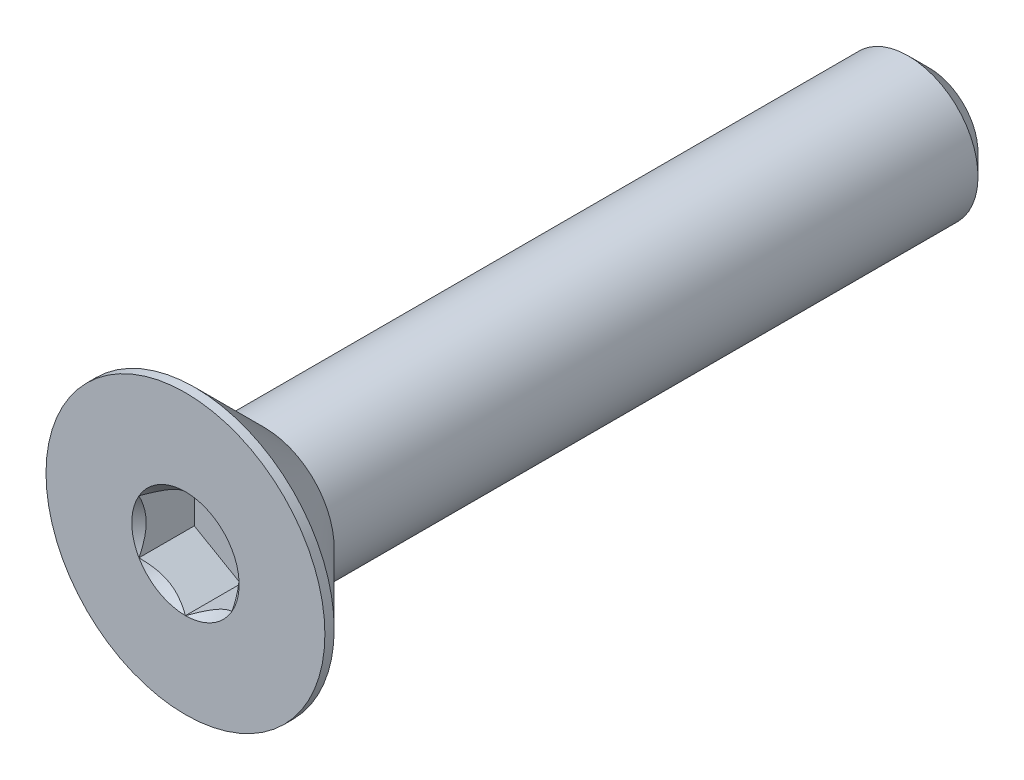
ISO-10303-21;
HEADER;
FILE_DESCRIPTION(('STEP AP214'),'2;1');
FILE_NAME('part.step','',(''),(''),'','','');
FILE_SCHEMA(('AUTOMOTIVE_DESIGN { 1 0 10303 214 1 1 1 1 }'));
ENDSEC;
DATA;
#1=APPLICATION_CONTEXT('core data for automotive mechanical design processes');
#2=APPLICATION_PROTOCOL_DEFINITION('international standard','automotive_design',2000,#1);
#3=PRODUCT_CONTEXT('',#1,'mechanical');
#4=PRODUCT('Part','Part','',(#3));
#5=PRODUCT_RELATED_PRODUCT_CATEGORY('part','',(#4));
#6=PRODUCT_DEFINITION_FORMATION('','',#4);
#7=PRODUCT_DEFINITION_CONTEXT('part definition',#1,'design');
#8=PRODUCT_DEFINITION('design','',#6,#7);
#9=PRODUCT_DEFINITION_SHAPE('','',#8);
#10=(LENGTH_UNIT() NAMED_UNIT(*) SI_UNIT(.MILLI.,.METRE.));
#11=(NAMED_UNIT(*) PLANE_ANGLE_UNIT() SI_UNIT($,.RADIAN.));
#12=(NAMED_UNIT(*) SI_UNIT($,.STERADIAN.) SOLID_ANGLE_UNIT());
#13=UNCERTAINTY_MEASURE_WITH_UNIT(LENGTH_MEASURE(1.E-05),#10,'distance_accuracy_value','');
#14=(GEOMETRIC_REPRESENTATION_CONTEXT(3) GLOBAL_UNCERTAINTY_ASSIGNED_CONTEXT((#13)) GLOBAL_UNIT_ASSIGNED_CONTEXT((#10,
#11,#12)) REPRESENTATION_CONTEXT('',''));
#15=CARTESIAN_POINT('',(0.,0.,0.));
#16=DIRECTION('',(0.,0.,1.));
#17=DIRECTION('',(1.,0.,0.));
#18=AXIS2_PLACEMENT_3D('',#15,#16,#17);
#19=CARTESIAN_POINT('',(0.,0.,-8.));
#20=DIRECTION('',(0.,0.,-1.));
#21=DIRECTION('',(0.,1.,0.));
#22=AXIS2_PLACEMENT_3D('',#19,#20,#21);
#23=CYLINDRICAL_SURFACE('',#22,1.5);
#24=CARTESIAN_POINT('',(0.,0.,6.3));
#25=DIRECTION('',(0.,0.,-1.));
#26=DIRECTION('',(0.,1.,0.));
#27=AXIS2_PLACEMENT_3D('',#24,#25,#26);
#28=CIRCLE('',#27,1.5);
#29=CARTESIAN_POINT('',(0.,1.5,6.3));
#30=VERTEX_POINT('',#29);
#31=EDGE_CURVE('E11',#30,#30,#28,.F.);
#32=ORIENTED_EDGE('',*,*,#31,.F.);
#33=EDGE_LOOP('',(#32));
#34=FACE_BOUND('',#33,.T.);
#35=CARTESIAN_POINT('',(0.,0.,-7.55));
#36=DIRECTION('',(0.,0.,-1.));
#37=DIRECTION('',(0.,1.,0.));
#38=AXIS2_PLACEMENT_3D('',#35,#36,#37);
#39=CIRCLE('',#38,1.5);
#40=CARTESIAN_POINT('',(0.,1.5,-7.55));
#41=VERTEX_POINT('',#40);
#42=EDGE_CURVE('E47',#41,#41,#39,.F.);
#43=ORIENTED_EDGE('',*,*,#42,.T.);
#44=EDGE_LOOP('',(#43));
#45=FACE_BOUND('',#44,.T.);
#46=ADVANCED_FACE('F39',(#34,#45),#23,.T.);
#47=CARTESIAN_POINT('',(0.,1.5,-8.));
#48=DIRECTION('',(0.,0.,-1.));
#49=DIRECTION('',(0.,1.,0.));
#50=AXIS2_PLACEMENT_3D('',#47,#48,#49);
#51=PLANE('',#50);
#52=CARTESIAN_POINT('',(0.,0.,-8.));
#53=DIRECTION('',(0.,0.,-1.));
#54=DIRECTION('',(0.,1.,0.));
#55=AXIS2_PLACEMENT_3D('',#52,#53,#54);
#56=CIRCLE('',#55,1.05);
#57=CARTESIAN_POINT('',(0.,1.05,-8.));
#58=VERTEX_POINT('',#57);
#59=EDGE_CURVE('E151',#58,#58,#56,.T.);
#60=ORIENTED_EDGE('',*,*,#59,.T.);
#61=EDGE_LOOP('',(#60));
#62=FACE_BOUND('',#61,.T.);
#63=ADVANCED_FACE('F160',(#62),#51,.T.);
#64=CARTESIAN_POINT('',(0.,0.,-8.));
#65=DIRECTION('',(0.,0.,1.));
#66=DIRECTION('',(0.,-1.,0.));
#67=AXIS2_PLACEMENT_3D('',#64,#65,#66);
#68=CONICAL_SURFACE('',#67,1.05,0.785398163397447);
#69=ORIENTED_EDGE('',*,*,#42,.F.);
#70=EDGE_LOOP('',(#69));
#71=FACE_BOUND('',#70,.T.);
#72=ORIENTED_EDGE('',*,*,#59,.F.);
#73=EDGE_LOOP('',(#72));
#74=FACE_BOUND('',#73,.T.);
#75=ADVANCED_FACE('F41',(#71,#74),#68,.T.);
#76=CARTESIAN_POINT('',(0.,0.,-8.));
#77=DIRECTION('',(0.,0.,-1.));
#78=DIRECTION('',(0.,1.,0.));
#79=AXIS2_PLACEMENT_3D('',#76,#77,#78);
#80=CYLINDRICAL_SURFACE('',#79,3.);
#81=CARTESIAN_POINT('',(0.,0.,8.));
#82=DIRECTION('',(0.,0.,-1.));
#83=DIRECTION('',(0.,1.,0.));
#84=AXIS2_PLACEMENT_3D('',#81,#82,#83);
#85=CIRCLE('',#84,3.);
#86=CARTESIAN_POINT('',(0.,3.,8.));
#87=VERTEX_POINT('',#86);
#88=EDGE_CURVE('E131',#87,#87,#85,.T.);
#89=ORIENTED_EDGE('',*,*,#88,.T.);
#90=EDGE_LOOP('',(#89));
#91=FACE_BOUND('',#90,.T.);
#92=CARTESIAN_POINT('',(0.,0.,7.79999999999999));
#93=DIRECTION('',(0.,0.,-1.));
#94=DIRECTION('',(0.,1.,0.));
#95=AXIS2_PLACEMENT_3D('',#92,#93,#94);
#96=CIRCLE('',#95,3.);
#97=CARTESIAN_POINT('',(0.,3.,7.79999999999999));
#98=VERTEX_POINT('',#97);
#99=EDGE_CURVE('E128',#98,#98,#96,.T.);
#100=ORIENTED_EDGE('',*,*,#99,.F.);
#101=EDGE_LOOP('',(#100));
#102=FACE_BOUND('',#101,.T.);
#103=ADVANCED_FACE('F159',(#91,#102),#80,.T.);
#104=CARTESIAN_POINT('',(0.,0.,6.3));
#105=DIRECTION('',(0.,0.,1.));
#106=DIRECTION('',(0.,-1.,0.));
#107=AXIS2_PLACEMENT_3D('',#104,#105,#106);
#108=CONICAL_SURFACE('',#107,1.5,0.78539816339745);
#109=ORIENTED_EDGE('',*,*,#99,.T.);
#110=EDGE_LOOP('',(#109));
#111=FACE_BOUND('',#110,.T.);
#112=ORIENTED_EDGE('',*,*,#31,.T.);
#113=EDGE_LOOP('',(#112));
#114=FACE_BOUND('',#113,.T.);
#115=ADVANCED_FACE('F173',(#111,#114),#108,.T.);
#116=CARTESIAN_POINT('',(0.,0.,8.));
#117=DIRECTION('',(0.,0.,1.));
#118=DIRECTION('',(0.,-1.,0.));
#119=AXIS2_PLACEMENT_3D('',#116,#117,#118);
#120=PLANE('',#119);
#121=CARTESIAN_POINT('',(0.,0.,8.));
#122=DIRECTION('',(0.,0.,1.));
#123=DIRECTION('',(1.,0.,0.));
#124=AXIS2_PLACEMENT_3D('',#121,#122,#123);
#125=CIRCLE('',#124,1.15470053837925);
#126=CARTESIAN_POINT('',(1.,0.577350269189631,8.));
#127=VERTEX_POINT('',#126);
#128=CARTESIAN_POINT('',(0.,1.15470053837926,8.));
#129=VERTEX_POINT('',#128);
#130=EDGE_CURVE('E98',#127,#129,#125,.T.);
#131=ORIENTED_EDGE('',*,*,#130,.F.);
#132=CARTESIAN_POINT('',(0.,0.,8.));
#133=DIRECTION('',(0.,0.,1.));
#134=DIRECTION('',(1.,0.,0.));
#135=AXIS2_PLACEMENT_3D('',#132,#133,#134);
#136=CIRCLE('',#135,1.15470053837925);
#137=CARTESIAN_POINT('',(0.999999999999989,-0.577350269189633,8.));
#138=VERTEX_POINT('',#137);
#139=EDGE_CURVE('E110',#138,#127,#136,.T.);
#140=ORIENTED_EDGE('',*,*,#139,.F.);
#141=CARTESIAN_POINT('',(0.,0.,8.));
#142=DIRECTION('',(0.,0.,1.));
#143=DIRECTION('',(1.,0.,0.));
#144=AXIS2_PLACEMENT_3D('',#141,#142,#143);
#145=CIRCLE('',#144,1.15470053837925);
#146=CARTESIAN_POINT('',(0.,-1.15470053837924,8.));
#147=VERTEX_POINT('',#146);
#148=EDGE_CURVE('E244',#147,#138,#145,.T.);
#149=ORIENTED_EDGE('',*,*,#148,.F.);
#150=CARTESIAN_POINT('',(0.,0.,8.));
#151=DIRECTION('',(0.,0.,1.));
#152=DIRECTION('',(1.,0.,0.));
#153=AXIS2_PLACEMENT_3D('',#150,#151,#152);
#154=CIRCLE('',#153,1.15470053837925);
#155=CARTESIAN_POINT('',(-1.,-0.577350269189614,8.));
#156=VERTEX_POINT('',#155);
#157=EDGE_CURVE('E123',#156,#147,#154,.T.);
#158=ORIENTED_EDGE('',*,*,#157,.F.);
#159=CARTESIAN_POINT('',(0.,0.,8.));
#160=DIRECTION('',(0.,0.,1.));
#161=DIRECTION('',(1.,0.,0.));
#162=AXIS2_PLACEMENT_3D('',#159,#160,#161);
#163=CIRCLE('',#162,1.15470053837925);
#164=CARTESIAN_POINT('',(-1.,0.577350269189624,8.));
#165=VERTEX_POINT('',#164);
#166=EDGE_CURVE('E245',#165,#156,#163,.T.);
#167=ORIENTED_EDGE('',*,*,#166,.F.);
#168=CARTESIAN_POINT('',(0.,0.,8.));
#169=DIRECTION('',(0.,0.,1.));
#170=DIRECTION('',(1.,0.,0.));
#171=AXIS2_PLACEMENT_3D('',#168,#169,#170);
#172=CIRCLE('',#171,1.15470053837925);
#173=EDGE_CURVE('E113',#129,#165,#172,.T.);
#174=ORIENTED_EDGE('',*,*,#173,.F.);
#175=EDGE_LOOP('',(#131,#140,#149,#158,#167,#174));
#176=FACE_BOUND('',#175,.T.);
#177=ORIENTED_EDGE('',*,*,#88,.F.);
#178=EDGE_LOOP('',(#177));
#179=FACE_BOUND('',#178,.T.);
#180=ADVANCED_FACE('F107',(#176,#179),#120,.T.);
#181=CARTESIAN_POINT('',(1.,0.577350269189626,6.81));
#182=DIRECTION('',(0.5,0.866025403784438,0.));
#183=DIRECTION('',(-0.866025403784439,0.5,0.));
#184=AXIS2_PLACEMENT_3D('',#181,#182,#183);
#185=PLANE('',#184);
#186=DIRECTION('',(0.,0.,1.));
#187=VECTOR('',#186,1.);
#188=CARTESIAN_POINT('',(1.,0.577350269189626,6.81));
#189=LINE('',#188,#187);
#190=CARTESIAN_POINT('',(1.,0.577350269189626,6.81));
#191=VERTEX_POINT('',#190);
#192=EDGE_CURVE('E54',#191,#127,#189,.T.);
#193=ORIENTED_EDGE('',*,*,#192,.T.);
#194=CARTESIAN_POINT('',(-0.000199999999999633,1.15481600843309,8.00011548737261));
#195=CARTESIAN_POINT('',(0.0341825950071807,1.13496520795026,7.98027793082573));
#196=CARTESIAN_POINT('',(0.0691401181398247,1.11478247255942,7.96160502063888));
#197=CARTESIAN_POINT('',(0.140422802956089,1.07362739529219,7.92741474272315));
#198=CARTESIAN_POINT('',(0.176754750528984,1.0526511355808,7.91191640902345));
#199=CARTESIAN_POINT('',(0.25001661380331,1.01035337909803,7.88536730714226));
#200=CARTESIAN_POINT('',(0.286927851445413,0.989042666109242,7.87424977399692));
#201=CARTESIAN_POINT('',(0.361562729310857,0.945952199282693,7.85711986577618));
#202=CARTESIAN_POINT('',(0.399284088108633,0.924173762626599,7.85109469746667));
#203=CARTESIAN_POINT('',(0.46429219841793,0.886641312640017,7.84566055496749));
#204=CARTESIAN_POINT('',(0.491494371528169,0.870936130672278,7.84485693831673));
#205=CARTESIAN_POINT('',(0.545846040669108,0.839556179862851,7.84620669941688));
#206=CARTESIAN_POINT('',(0.572995523754872,0.823881418494926,7.8483607295472));
#207=CARTESIAN_POINT('',(0.654056277326956,0.77708097059937,7.85911697212847));
#208=CARTESIAN_POINT('',(0.707564140978422,0.746188191116434,7.87201455641535));
#209=CARTESIAN_POINT('',(0.801476065143427,0.691968116419652,7.90314073060217));
#210=CARTESIAN_POINT('',(0.842320523671831,0.668386557293374,7.91973779770183));
#211=CARTESIAN_POINT('',(0.922409637381942,0.622147085933683,7.95712492468529));
#212=CARTESIAN_POINT('',(0.961659010870436,0.599486449584576,7.9779013418174));
#213=CARTESIAN_POINT('',(1.0002,0.577234799135789,8.00011548737261));
#214=B_SPLINE_CURVE_WITH_KNOTS('',3,(#194,#195,#196,#197,#198,#199,#200,#201,#202,#203,#204,
#205,#206,#207,#208,#209,#210,#211,#212,#213),.UNSPECIFIED.,.F.,.F.,(4,2,2,2,2,2,2,2,2,4),(0.,
0.133237676828558,0.267252229834488,0.399137076269297,0.530689603280764,0.624814864263841,
0.718960890149127,0.90730662611209,1.05710100361789,1.20641411519286),.UNSPECIFIED.);
#215=EDGE_CURVE('E95',#129,#127,#214,.T.);
#216=ORIENTED_EDGE('',*,*,#215,.F.);
#217=DIRECTION('',(0.,0.,1.));
#218=VECTOR('',#217,1.);
#219=CARTESIAN_POINT('',(0.,1.15470053837925,6.81));
#220=LINE('',#219,#218);
#221=CARTESIAN_POINT('',(0.,1.15470053837925,6.81));
#222=VERTEX_POINT('',#221);
#223=EDGE_CURVE('E147',#222,#129,#220,.T.);
#224=ORIENTED_EDGE('',*,*,#223,.F.);
#225=DIRECTION('',(-0.866025403784439,0.5,0.));
#226=VECTOR('',#225,1.);
#227=CARTESIAN_POINT('',(1.,0.577350269189626,6.81));
#228=LINE('',#227,#226);
#229=EDGE_CURVE('E120',#191,#222,#228,.T.);
#230=ORIENTED_EDGE('',*,*,#229,.F.);
#231=EDGE_LOOP('',(#193,#216,#224,#230));
#232=FACE_BOUND('',#231,.T.);
#233=ADVANCED_FACE('F125',(#232),#185,.F.);
#234=CARTESIAN_POINT('',(1.,-0.577350269189627,6.81));
#235=DIRECTION('',(1.,0.,0.));
#236=DIRECTION('',(0.,0.,-1.));
#237=AXIS2_PLACEMENT_3D('',#234,#235,#236);
#238=PLANE('',#237);
#239=DIRECTION('',(0.,0.,1.));
#240=VECTOR('',#239,1.);
#241=CARTESIAN_POINT('',(1.,-0.577350269189627,6.81));
#242=LINE('',#241,#240);
#243=CARTESIAN_POINT('',(1.,-0.577350269189627,6.81));
#244=VERTEX_POINT('',#243);
#245=EDGE_CURVE('E62',#244,#138,#242,.T.);
#246=ORIENTED_EDGE('',*,*,#245,.T.);
#247=CARTESIAN_POINT('',(1.,-1.15147208646462,8.37038567751388));
#248=CARTESIAN_POINT('',(1.,-1.12343447988553,8.34921991987373));
#249=CARTESIAN_POINT('',(1.,-1.09524064850698,8.32826169217592));
#250=CARTESIAN_POINT('',(1.,-1.03847715644377,8.28684602223563));
#251=CARTESIAN_POINT('',(1.,-1.00990740382976,8.26638870612367));
#252=CARTESIAN_POINT('',(1.,-0.923120894333482,8.20560479495452));
#253=CARTESIAN_POINT('',(1.,-0.864253173759065,8.16619222896141));
#254=CARTESIAN_POINT('',(1.,-0.740809858258049,8.08882066420021));
#255=CARTESIAN_POINT('',(1.,-0.676100255137809,8.05107303911435));
#256=CARTESIAN_POINT('',(1.,-0.543448939049125,7.9820245875513));
#257=CARTESIAN_POINT('',(1.,-0.475519112027779,7.95070202784687));
#258=CARTESIAN_POINT('',(1.,-0.373555850333528,7.9123817788838));
#259=CARTESIAN_POINT('',(1.,-0.341031989670906,7.90138359164216));
#260=CARTESIAN_POINT('',(1.,-0.275199079052291,7.88199834214736));
#261=CARTESIAN_POINT('',(1.,-0.241889975173931,7.8736114597767));
#262=CARTESIAN_POINT('',(1.,-0.17524751704299,7.86002522071902));
#263=CARTESIAN_POINT('',(1.,-0.141925568218172,7.85477079076797));
#264=CARTESIAN_POINT('',(1.,-0.074914436232275,7.84754868657089));
#265=CARTESIAN_POINT('',(1.,-0.0412251978501574,7.84558151361051));
#266=CARTESIAN_POINT('',(1.,0.0249580992634259,7.84508319839316));
#267=CARTESIAN_POINT('',(1.,0.0574512826460445,7.84643026788863));
#268=CARTESIAN_POINT('',(1.,0.122148505701872,7.85221648449899));
#269=CARTESIAN_POINT('',(1.,0.154352610132932,7.85665492066154));
#270=CARTESIAN_POINT('',(1.,0.218799898867646,7.8684568301452));
#271=CARTESIAN_POINT('',(1.,0.25103374326896,7.87587054103851));
#272=CARTESIAN_POINT('',(1.,0.314797132354926,7.89322894249868));
#273=CARTESIAN_POINT('',(1.,0.346326735731012,7.90317342128883));
#274=CARTESIAN_POINT('',(1.,0.445594187730212,7.93822348255434));
#275=CARTESIAN_POINT('',(1.,0.511919139476044,7.96732085835672));
#276=CARTESIAN_POINT('',(1.,0.641453244657539,8.0320153296865));
#277=CARTESIAN_POINT('',(1.,0.704650133126351,8.06763577671524));
#278=CARTESIAN_POINT('',(1.,0.825428490174993,8.14112390134694));
#279=CARTESIAN_POINT('',(1.,0.88313294786769,8.17879194713546));
#280=CARTESIAN_POINT('',(1.,0.968148853704571,8.23702285294316));
#281=CARTESIAN_POINT('',(1.,0.996120570380291,8.25663847576286));
#282=CARTESIAN_POINT('',(1.,1.05168177729902,8.29638851706127));
#283=CARTESIAN_POINT('',(1.,1.07927136997701,8.31652279219883));
#284=CARTESIAN_POINT('',(1.,1.1067018534633,8.33687211907297));
#285=B_SPLINE_CURVE_WITH_KNOTS('',3,(#247,#248,#249,#250,#251,#252,#253,#254,#255,#256,#257,
#258,#259,#260,#261,#262,#263,#264,#265,#266,#267,#268,#269,#270,#271,#272,#273,#274,#275,#276,
#277,#278,#279,#280,#281,#282,#283,#284),.UNSPECIFIED.,.F.,.F.,(4,2,2,2,2,2,2,2,2,2,2,2,2,2,2,2,
2,2,4),(0.,0.105386459083292,0.210799187330128,0.423233611565475,0.647793540908515,
0.871580877738623,0.974493074181435,1.07741235827203,1.17846428203206,1.27953161415764,
1.37694086739612,1.4743277258541,1.57343322804295,1.67253043972853,1.88917353996829,
2.10660791038815,2.31323734249845,2.41572589232046,2.51818641476505),.UNSPECIFIED.);
#286=EDGE_CURVE('E119',#127,#138,#285,.F.);
#287=ORIENTED_EDGE('',*,*,#286,.F.);
#288=ORIENTED_EDGE('',*,*,#192,.F.);
#289=DIRECTION('',(0.,1.,0.));
#290=VECTOR('',#289,1.);
#291=CARTESIAN_POINT('',(1.,-0.577350269189627,6.81));
#292=LINE('',#291,#290);
#293=EDGE_CURVE('E136',#244,#191,#292,.T.);
#294=ORIENTED_EDGE('',*,*,#293,.F.);
#295=EDGE_LOOP('',(#246,#287,#288,#294));
#296=FACE_BOUND('',#295,.T.);
#297=ADVANCED_FACE('F122',(#296),#238,.F.);
#298=CARTESIAN_POINT('',(0.,-1.15470053837925,6.81));
#299=DIRECTION('',(0.5,-0.866025403784439,0.));
#300=DIRECTION('',(0.866025403784439,0.5,0.));
#301=AXIS2_PLACEMENT_3D('',#298,#299,#300);
#302=PLANE('',#301);
#303=DIRECTION('',(0.,0.,1.));
#304=VECTOR('',#303,1.);
#305=CARTESIAN_POINT('',(0.,-1.15470053837925,6.81));
#306=LINE('',#305,#304);
#307=CARTESIAN_POINT('',(0.,-1.15470053837925,6.81));
#308=VERTEX_POINT('',#307);
#309=EDGE_CURVE('E133',#308,#147,#306,.T.);
#310=ORIENTED_EDGE('',*,*,#309,.T.);
#311=CARTESIAN_POINT('',(1.0002,-0.577234799135789,8.00011548737262));
#312=CARTESIAN_POINT('',(0.965817404992819,-0.597085599618622,7.98027793082574));
#313=CARTESIAN_POINT('',(0.930859881860175,-0.617268335009457,7.9616050206389));
#314=CARTESIAN_POINT('',(0.859577197043911,-0.658423412276686,7.92741474272316));
#315=CARTESIAN_POINT('',(0.823245249471016,-0.67939967198808,7.91191640902347));
#316=CARTESIAN_POINT('',(0.74998338619669,-0.721697428470846,7.88536730714227));
#317=CARTESIAN_POINT('',(0.713072148554587,-0.743008141459636,7.87424977399693));
#318=CARTESIAN_POINT('',(0.638437270689143,-0.786098608286185,7.85711986577619));
#319=CARTESIAN_POINT('',(0.600715911891367,-0.80787704494228,7.85109469746668));
#320=CARTESIAN_POINT('',(0.535707801582069,-0.845409494928862,7.8456605549675));
#321=CARTESIAN_POINT('',(0.50850562847183,-0.861114676896601,7.84485693831674));
#322=CARTESIAN_POINT('',(0.45415395933089,-0.892494627706028,7.8462066994169));
#323=CARTESIAN_POINT('',(0.427004476245126,-0.908169389073953,7.84836072954721));
#324=CARTESIAN_POINT('',(0.345943722673041,-0.95496983696951,7.85911697212848));
#325=CARTESIAN_POINT('',(0.292435859021573,-0.985862616452447,7.87201455641537));
#326=CARTESIAN_POINT('',(0.198523934856569,-1.04008269114923,7.90314073060219));
#327=CARTESIAN_POINT('',(0.157679476328167,-1.06366425027551,7.91973779770185));
#328=CARTESIAN_POINT('',(0.0775903626180573,-1.1099037216352,7.9571249246853));
#329=CARTESIAN_POINT('',(0.038340989129563,-1.1325643579843,7.97790134181741));
#330=CARTESIAN_POINT('',(-0.000199999999999759,-1.15481600843309,8.00011548737262));
#331=B_SPLINE_CURVE_WITH_KNOTS('',3,(#311,#312,#313,#314,#315,#316,#317,#318,#319,#320,#321,
#322,#323,#324,#325,#326,#327,#328,#329,#330),.UNSPECIFIED.,.F.,.F.,(4,2,2,2,2,2,2,2,2,4),(0.,
0.133237676828559,0.267252229834488,0.399137076269297,0.530689603280764,0.624814864263842,
0.71896089014913,0.907306626112095,1.05710100361789,1.20641411519286),.UNSPECIFIED.);
#332=EDGE_CURVE('E242',#138,#147,#331,.T.);
#333=ORIENTED_EDGE('',*,*,#332,.F.);
#334=ORIENTED_EDGE('',*,*,#245,.F.);
#335=DIRECTION('',(0.866025403784439,0.5,0.));
#336=VECTOR('',#335,1.);
#337=CARTESIAN_POINT('',(0.,-1.15470053837925,6.81));
#338=LINE('',#337,#336);
#339=EDGE_CURVE('E234',#308,#244,#338,.T.);
#340=ORIENTED_EDGE('',*,*,#339,.F.);
#341=EDGE_LOOP('',(#310,#333,#334,#340));
#342=FACE_BOUND('',#341,.T.);
#343=ADVANCED_FACE('F199',(#342),#302,.F.);
#344=CARTESIAN_POINT('',(-1.,-0.577350269189626,6.81));
#345=DIRECTION('',(-0.5,-0.866025403784439,0.));
#346=DIRECTION('',(0.866025403784439,-0.5,0.));
#347=AXIS2_PLACEMENT_3D('',#344,#345,#346);
#348=PLANE('',#347);
#349=DIRECTION('',(0.,0.,1.));
#350=VECTOR('',#349,1.);
#351=CARTESIAN_POINT('',(-1.,-0.577350269189626,6.81));
#352=LINE('',#351,#350);
#353=CARTESIAN_POINT('',(-1.,-0.577350269189626,6.81));
#354=VERTEX_POINT('',#353);
#355=EDGE_CURVE('E141',#354,#156,#352,.T.);
#356=ORIENTED_EDGE('',*,*,#355,.T.);
#357=CARTESIAN_POINT('',(0.000199999999999887,-1.15481600843309,8.00011548737262));
#358=CARTESIAN_POINT('',(-0.0341825950071811,-1.13496520795026,7.98027793082574));
#359=CARTESIAN_POINT('',(-0.0691401181398255,-1.11478247255942,7.9616050206389));
#360=CARTESIAN_POINT('',(-0.140422802956091,-1.07362739529219,7.92741474272317));
#361=CARTESIAN_POINT('',(-0.176754750528985,-1.0526511355808,7.91191640902347));
#362=CARTESIAN_POINT('',(-0.250016613803313,-1.01035337909803,7.88536730714227));
#363=CARTESIAN_POINT('',(-0.286927851445416,-0.98904266610924,7.87424977399694));
#364=CARTESIAN_POINT('',(-0.361562729310861,-0.94595219928269,7.85711986577619));
#365=CARTESIAN_POINT('',(-0.399284088108638,-0.924173762626595,7.85109469746668));
#366=CARTESIAN_POINT('',(-0.464292198417936,-0.886641312640013,7.8456605549675));
#367=CARTESIAN_POINT('',(-0.491494371528175,-0.870936130672274,7.84485693831674));
#368=CARTESIAN_POINT('',(-0.545846040669115,-0.839556179862847,7.8462066994169));
#369=CARTESIAN_POINT('',(-0.572995523754879,-0.823881418494922,7.84836072954721));
#370=CARTESIAN_POINT('',(-0.654056277326964,-0.777080970599365,7.85911697212848));
#371=CARTESIAN_POINT('',(-0.707564140978432,-0.746188191116428,7.87201455641537));
#372=CARTESIAN_POINT('',(-0.801476065143435,-0.691968116419647,7.90314073060219));
#373=CARTESIAN_POINT('',(-0.842320523671837,-0.66838655729337,7.91973779770185));
#374=CARTESIAN_POINT('',(-0.922409637381945,-0.622147085933681,7.9571249246853));
#375=CARTESIAN_POINT('',(-0.961659010870438,-0.599486449584575,7.97790134181741));
#376=CARTESIAN_POINT('',(-1.0002,-0.577234799135788,8.00011548737262));
#377=B_SPLINE_CURVE_WITH_KNOTS('',3,(#357,#358,#359,#360,#361,#362,#363,#364,#365,#366,#367,
#368,#369,#370,#371,#372,#373,#374,#375,#376),.UNSPECIFIED.,.F.,.F.,(4,2,2,2,2,2,2,2,2,4),(0.,
0.13323767682856,0.267252229834491,0.399137076269302,0.530689603280771,0.624814864263849,
0.718960890149137,0.907306626112103,1.0571010036179,1.20641411519286),.UNSPECIFIED.);
#378=EDGE_CURVE('E216',#147,#156,#377,.T.);
#379=ORIENTED_EDGE('',*,*,#378,.F.);
#380=ORIENTED_EDGE('',*,*,#309,.F.);
#381=DIRECTION('',(0.866025403784439,-0.5,0.));
#382=VECTOR('',#381,1.);
#383=CARTESIAN_POINT('',(-1.,-0.577350269189626,6.81));
#384=LINE('',#383,#382);
#385=EDGE_CURVE('E232',#354,#308,#384,.T.);
#386=ORIENTED_EDGE('',*,*,#385,.F.);
#387=EDGE_LOOP('',(#356,#379,#380,#386));
#388=FACE_BOUND('',#387,.T.);
#389=ADVANCED_FACE('F195',(#388),#348,.F.);
#390=CARTESIAN_POINT('',(-1.,0.577350269189626,6.81));
#391=DIRECTION('',(-1.,0.,0.));
#392=DIRECTION('',(0.,-1.,0.));
#393=AXIS2_PLACEMENT_3D('',#390,#391,#392);
#394=PLANE('',#393);
#395=DIRECTION('',(0.,0.,1.));
#396=VECTOR('',#395,1.);
#397=CARTESIAN_POINT('',(-1.,0.577350269189626,6.81));
#398=LINE('',#397,#396);
#399=CARTESIAN_POINT('',(-1.,0.577350269189626,6.81));
#400=VERTEX_POINT('',#399);
#401=EDGE_CURVE('E144',#400,#165,#398,.T.);
#402=ORIENTED_EDGE('',*,*,#401,.T.);
#403=CARTESIAN_POINT('',(-1.,-1.15147208646462,8.37038567751387));
#404=CARTESIAN_POINT('',(-1.,-1.12343447988553,8.34921991987373));
#405=CARTESIAN_POINT('',(-1.,-1.09524064850698,8.32826169217592));
#406=CARTESIAN_POINT('',(-1.,-1.03847715644377,8.28684602223563));
#407=CARTESIAN_POINT('',(-1.,-1.00990740382975,8.26638870612367));
#408=CARTESIAN_POINT('',(-1.,-0.923120894333481,8.20560479495452));
#409=CARTESIAN_POINT('',(-1.,-0.864253173759062,8.16619222896141));
#410=CARTESIAN_POINT('',(-1.,-0.740809858258047,8.08882066420021));
#411=CARTESIAN_POINT('',(-1.,-0.676100255137808,8.05107303911435));
#412=CARTESIAN_POINT('',(-1.,-0.543448939049124,7.9820245875513));
#413=CARTESIAN_POINT('',(-1.,-0.475519112027778,7.95070202784687));
#414=CARTESIAN_POINT('',(-1.,-0.373555850333527,7.9123817788838));
#415=CARTESIAN_POINT('',(-1.,-0.341031989670906,7.90138359164216));
#416=CARTESIAN_POINT('',(-1.,-0.27519907905229,7.88199834214736));
#417=CARTESIAN_POINT('',(-1.,-0.24188997517393,7.8736114597767));
#418=CARTESIAN_POINT('',(-1.,-0.175247517042989,7.86002522071902));
#419=CARTESIAN_POINT('',(-1.,-0.141925568218171,7.85477079076797));
#420=CARTESIAN_POINT('',(-1.,-0.0749144362322744,7.84754868657089));
#421=CARTESIAN_POINT('',(-1.,-0.0412251978501569,7.84558151361051));
#422=CARTESIAN_POINT('',(-1.,0.0249580992634263,7.84508319839316));
#423=CARTESIAN_POINT('',(-1.,0.0574512826460448,7.84643026788864));
#424=CARTESIAN_POINT('',(-1.,0.122148505701873,7.85221648449898));
#425=CARTESIAN_POINT('',(-1.,0.154352610132933,7.85665492066154));
#426=CARTESIAN_POINT('',(-1.,0.218799898867646,7.86845683014521));
#427=CARTESIAN_POINT('',(-1.,0.25103374326896,7.87587054103851));
#428=CARTESIAN_POINT('',(-1.,0.314797132354926,7.89322894249868));
#429=CARTESIAN_POINT('',(-1.,0.346326735731012,7.90317342128883));
#430=CARTESIAN_POINT('',(-1.,0.445594187730212,7.93822348255434));
#431=CARTESIAN_POINT('',(-1.,0.511919139476044,7.96732085835673));
#432=CARTESIAN_POINT('',(-1.,0.641453244657539,8.03201532968651));
#433=CARTESIAN_POINT('',(-1.,0.704650133126351,8.06763577671524));
#434=CARTESIAN_POINT('',(-1.,0.825428490174993,8.14112390134694));
#435=CARTESIAN_POINT('',(-1.,0.88313294786769,8.17879194713546));
#436=CARTESIAN_POINT('',(-1.,0.968148853704571,8.23702285294316));
#437=CARTESIAN_POINT('',(-1.,0.996120570380291,8.25663847576286));
#438=CARTESIAN_POINT('',(-1.,1.05168177729902,8.29638851706127));
#439=CARTESIAN_POINT('',(-1.,1.07927136997701,8.31652279219883));
#440=CARTESIAN_POINT('',(-1.,1.1067018534633,8.33687211907297));
#441=B_SPLINE_CURVE_WITH_KNOTS('',3,(#403,#404,#405,#406,#407,#408,#409,#410,#411,#412,#413,
#414,#415,#416,#417,#418,#419,#420,#421,#422,#423,#424,#425,#426,#427,#428,#429,#430,#431,#432,
#433,#434,#435,#436,#437,#438,#439,#440),.UNSPECIFIED.,.F.,.F.,(4,2,2,2,2,2,2,2,2,2,2,2,2,2,2,2,
2,2,4),(0.,0.105386459083291,0.210799187330127,0.423233611565475,0.647793540908511,
0.871580877738621,0.974493074181433,1.07741235827203,1.17846428203206,1.27953161415764,
1.37694086739612,1.47432772585409,1.57343322804295,1.67253043972853,1.88917353996829,
2.10660791038815,2.31323734249845,2.41572589232046,2.51818641476505),.UNSPECIFIED.);
#442=EDGE_CURVE('E101',#156,#165,#441,.T.);
#443=ORIENTED_EDGE('',*,*,#442,.F.);
#444=ORIENTED_EDGE('',*,*,#355,.F.);
#445=DIRECTION('',(0.,-1.,0.));
#446=VECTOR('',#445,1.);
#447=CARTESIAN_POINT('',(-1.,0.577350269189626,6.81));
#448=LINE('',#447,#446);
#449=EDGE_CURVE('E229',#400,#354,#448,.T.);
#450=ORIENTED_EDGE('',*,*,#449,.F.);
#451=EDGE_LOOP('',(#402,#443,#444,#450));
#452=FACE_BOUND('',#451,.T.);
#453=ADVANCED_FACE('F191',(#452),#394,.F.);
#454=CARTESIAN_POINT('',(0.,1.15470053837925,6.81));
#455=DIRECTION('',(-0.5,0.866025403784439,0.));
#456=DIRECTION('',(-0.866025403784439,-0.5,0.));
#457=AXIS2_PLACEMENT_3D('',#454,#455,#456);
#458=PLANE('',#457);
#459=ORIENTED_EDGE('',*,*,#223,.T.);
#460=CARTESIAN_POINT('',(-1.0002,0.577234799135788,8.00011548737261));
#461=CARTESIAN_POINT('',(-0.965817404992819,0.597085599618622,7.98027793082573));
#462=CARTESIAN_POINT('',(-0.930859881860175,0.617268335009457,7.96160502063888));
#463=CARTESIAN_POINT('',(-0.859577197043909,0.658423412276687,7.92741474272315));
#464=CARTESIAN_POINT('',(-0.823245249471015,0.679399671988081,7.91191640902346));
#465=CARTESIAN_POINT('',(-0.749983386196687,0.721697428470848,7.88536730714226));
#466=CARTESIAN_POINT('',(-0.713072148554583,0.743008141459638,7.87424977399692));
#467=CARTESIAN_POINT('',(-0.638437270689138,0.786098608286188,7.85711986577618));
#468=CARTESIAN_POINT('',(-0.600715911891362,0.807877044942283,7.85109469746667));
#469=CARTESIAN_POINT('',(-0.535707801582064,0.845409494928865,7.84566055496749));
#470=CARTESIAN_POINT('',(-0.508505628471825,0.861114676896604,7.84485693831673));
#471=CARTESIAN_POINT('',(-0.454153959330886,0.892494627706031,7.84620669941688));
#472=CARTESIAN_POINT('',(-0.427004476245122,0.908169389073955,7.84836072954719));
#473=CARTESIAN_POINT('',(-0.345943722673038,0.954969836969512,7.85911697212847));
#474=CARTESIAN_POINT('',(-0.292435859021571,0.985862616452448,7.87201455641535));
#475=CARTESIAN_POINT('',(-0.198523934856568,1.04008269114923,7.90314073060217));
#476=CARTESIAN_POINT('',(-0.157679476328165,1.06366425027551,7.91973779770183));
#477=CARTESIAN_POINT('',(-0.0775903626180561,1.1099037216352,7.95712492468529));
#478=CARTESIAN_POINT('',(-0.0383409891295622,1.1325643579843,7.9779013418174));
#479=CARTESIAN_POINT('',(0.000199999999999796,1.15481600843309,8.00011548737261));
#480=B_SPLINE_CURVE_WITH_KNOTS('',3,(#460,#461,#462,#463,#464,#465,#466,#467,#468,#469,#470,
#471,#472,#473,#474,#475,#476,#477,#478,#479),.UNSPECIFIED.,.F.,.F.,(4,2,2,2,2,2,2,2,2,4),(0.,
0.133237676828561,0.267252229834493,0.399137076269303,0.530689603280772,0.624814864263849,
0.718960890149136,0.907306626112099,1.0571010036179,1.20641411519286),.UNSPECIFIED.);
#481=EDGE_CURVE('E238',#165,#129,#480,.T.);
#482=ORIENTED_EDGE('',*,*,#481,.F.);
#483=ORIENTED_EDGE('',*,*,#401,.F.);
#484=DIRECTION('',(-0.866025403784439,-0.5,0.));
#485=VECTOR('',#484,1.);
#486=CARTESIAN_POINT('',(0.,1.15470053837925,6.81));
#487=LINE('',#486,#485);
#488=EDGE_CURVE('E226',#222,#400,#487,.T.);
#489=ORIENTED_EDGE('',*,*,#488,.F.);
#490=EDGE_LOOP('',(#459,#482,#483,#489));
#491=FACE_BOUND('',#490,.T.);
#492=ADVANCED_FACE('F187',(#491),#458,.F.);
#493=CARTESIAN_POINT('',(0.,0.,6.81));
#494=DIRECTION('',(0.,0.,1.));
#495=DIRECTION('',(1.,0.,0.));
#496=AXIS2_PLACEMENT_3D('',#493,#494,#495);
#497=PLANE('',#496);
#498=ORIENTED_EDGE('',*,*,#229,.T.);
#499=ORIENTED_EDGE('',*,*,#488,.T.);
#500=ORIENTED_EDGE('',*,*,#449,.T.);
#501=ORIENTED_EDGE('',*,*,#385,.T.);
#502=ORIENTED_EDGE('',*,*,#339,.T.);
#503=ORIENTED_EDGE('',*,*,#293,.T.);
#504=EDGE_LOOP('',(#498,#499,#500,#501,#502,#503));
#505=FACE_BOUND('',#504,.T.);
#506=ADVANCED_FACE('F190',(#505),#497,.T.);
#507=CARTESIAN_POINT('',(0.,0.,8.));
#508=DIRECTION('',(0.,0.,1.));
#509=DIRECTION('',(1.,0.,0.));
#510=AXIS2_PLACEMENT_3D('',#507,#508,#509);
#511=CONICAL_SURFACE('',#510,1.15470053837925,0.78539816339745);
#512=ORIENTED_EDGE('',*,*,#481,.T.);
#513=ORIENTED_EDGE('',*,*,#173,.T.);
#514=EDGE_LOOP('',(#512,#513));
#515=FACE_BOUND('',#514,.T.);
#516=ADVANCED_FACE('F206',(#515),#511,.F.);
#517=CARTESIAN_POINT('',(0.,0.,8.));
#518=DIRECTION('',(0.,0.,1.));
#519=DIRECTION('',(1.,0.,0.));
#520=AXIS2_PLACEMENT_3D('',#517,#518,#519);
#521=CONICAL_SURFACE('',#520,1.15470053837925,0.78539816339745);
#522=ORIENTED_EDGE('',*,*,#378,.T.);
#523=ORIENTED_EDGE('',*,*,#157,.T.);
#524=EDGE_LOOP('',(#522,#523));
#525=FACE_BOUND('',#524,.T.);
#526=ADVANCED_FACE('F208',(#525),#521,.F.);
#527=CARTESIAN_POINT('',(0.,0.,8.));
#528=DIRECTION('',(0.,0.,1.));
#529=DIRECTION('',(1.,0.,0.));
#530=AXIS2_PLACEMENT_3D('',#527,#528,#529);
#531=CONICAL_SURFACE('',#530,1.15470053837925,0.78539816339745);
#532=ORIENTED_EDGE('',*,*,#286,.T.);
#533=ORIENTED_EDGE('',*,*,#139,.T.);
#534=EDGE_LOOP('',(#532,#533));
#535=FACE_BOUND('',#534,.T.);
#536=ADVANCED_FACE('F118',(#535),#531,.F.);
#537=CARTESIAN_POINT('',(0.,0.,8.));
#538=DIRECTION('',(0.,0.,1.));
#539=DIRECTION('',(1.,0.,0.));
#540=AXIS2_PLACEMENT_3D('',#537,#538,#539);
#541=CONICAL_SURFACE('',#540,1.15470053837925,0.78539816339745);
#542=ORIENTED_EDGE('',*,*,#332,.T.);
#543=ORIENTED_EDGE('',*,*,#148,.T.);
#544=EDGE_LOOP('',(#542,#543));
#545=FACE_BOUND('',#544,.T.);
#546=ADVANCED_FACE('F257',(#545),#541,.F.);
#547=CARTESIAN_POINT('',(0.,0.,8.));
#548=DIRECTION('',(0.,0.,1.));
#549=DIRECTION('',(1.,0.,0.));
#550=AXIS2_PLACEMENT_3D('',#547,#548,#549);
#551=CONICAL_SURFACE('',#550,1.15470053837925,0.78539816339745);
#552=ORIENTED_EDGE('',*,*,#442,.T.);
#553=ORIENTED_EDGE('',*,*,#166,.T.);
#554=EDGE_LOOP('',(#552,#553));
#555=FACE_BOUND('',#554,.T.);
#556=ADVANCED_FACE('F262',(#555),#551,.F.);
#557=CARTESIAN_POINT('',(0.,0.,8.));
#558=DIRECTION('',(0.,0.,1.));
#559=DIRECTION('',(1.,0.,0.));
#560=AXIS2_PLACEMENT_3D('',#557,#558,#559);
#561=CONICAL_SURFACE('',#560,1.15470053837925,0.78539816339745);
#562=ORIENTED_EDGE('',*,*,#215,.T.);
#563=ORIENTED_EDGE('',*,*,#130,.T.);
#564=EDGE_LOOP('',(#562,#563));
#565=FACE_BOUND('',#564,.T.);
#566=ADVANCED_FACE('F97',(#565),#561,.F.);
#567=CLOSED_SHELL('',(#46,#63,#75,#103,#115,#180,#233,#297,#343,#389,#453,#492,#506,#516,#526,
#536,#546,#556,#566));
#568=MANIFOLD_SOLID_BREP('B2',#567);
#569=ADVANCED_BREP_SHAPE_REPRESENTATION('',(#18,#568),#14);
#570=SHAPE_DEFINITION_REPRESENTATION(#9,#569);
ENDSEC;
END-ISO-10303-21;
